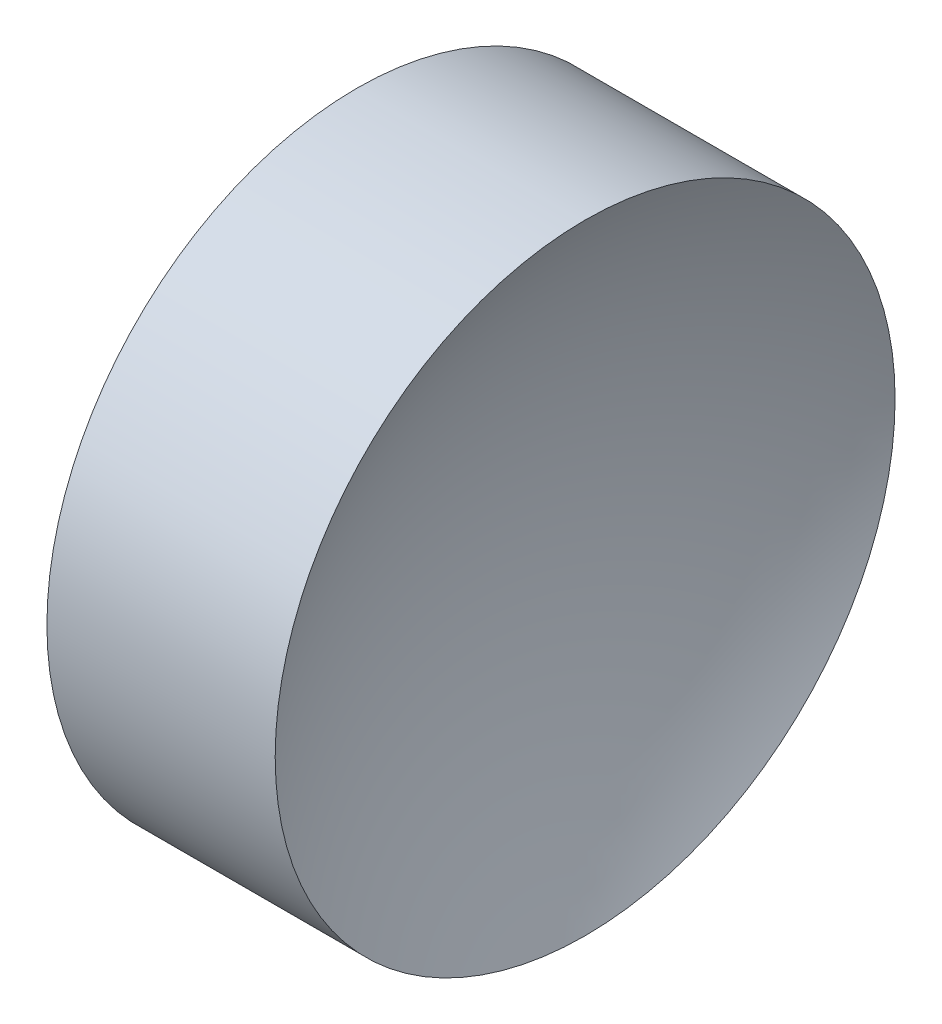
ISO-10303-21;
HEADER;
FILE_DESCRIPTION(('STEP AP214'),'2;1');
FILE_NAME('part.step','',(''),(''),'','','');
FILE_SCHEMA(('AUTOMOTIVE_DESIGN { 1 0 10303 214 1 1 1 1 }'));
ENDSEC;
DATA;
#1=APPLICATION_CONTEXT('core data for automotive mechanical design processes');
#2=APPLICATION_PROTOCOL_DEFINITION('international standard','automotive_design',2000,#1);
#3=PRODUCT_CONTEXT('',#1,'mechanical');
#4=PRODUCT('Part','Part','',(#3));
#5=PRODUCT_RELATED_PRODUCT_CATEGORY('part','',(#4));
#6=PRODUCT_DEFINITION_FORMATION('','',#4);
#7=PRODUCT_DEFINITION_CONTEXT('part definition',#1,'design');
#8=PRODUCT_DEFINITION('design','',#6,#7);
#9=PRODUCT_DEFINITION_SHAPE('','',#8);
#10=(LENGTH_UNIT() NAMED_UNIT(*) SI_UNIT(.MILLI.,.METRE.));
#11=(NAMED_UNIT(*) PLANE_ANGLE_UNIT() SI_UNIT($,.RADIAN.));
#12=(NAMED_UNIT(*) SI_UNIT($,.STERADIAN.) SOLID_ANGLE_UNIT());
#13=UNCERTAINTY_MEASURE_WITH_UNIT(LENGTH_MEASURE(1.E-05),#10,'distance_accuracy_value','');
#14=(GEOMETRIC_REPRESENTATION_CONTEXT(3) GLOBAL_UNCERTAINTY_ASSIGNED_CONTEXT((#13)) GLOBAL_UNIT_ASSIGNED_CONTEXT((#10,
#11,#12)) REPRESENTATION_CONTEXT('',''));
#15=CARTESIAN_POINT('',(0.,0.,0.));
#16=DIRECTION('',(0.,0.,1.));
#17=DIRECTION('',(1.,0.,0.));
#18=AXIS2_PLACEMENT_3D('',#15,#16,#17);
#19=CARTESIAN_POINT('',(30.1308954596777,13.0445205745975,0.));
#20=DIRECTION('',(-1.,0.,0.));
#21=DIRECTION('',(0.,-1.,0.));
#22=AXIS2_PLACEMENT_3D('',#19,#20,#21);
#23=SPHERICAL_SURFACE('',#22,6.45890897747901);
#24=CARTESIAN_POINT('',(24.4921894752023,13.0445205745975,0.));
#25=DIRECTION('',(-1.,0.,0.));
#26=DIRECTION('',(0.,0.,1.));
#27=AXIS2_PLACEMENT_3D('',#24,#25,#26);
#28=CIRCLE('',#27,3.15);
#29=CARTESIAN_POINT('',(24.4921894752023,13.0445205745975,3.15));
#30=VERTEX_POINT('',#29);
#31=EDGE_CURVE('E10',#30,#30,#28,.T.);
#32=ORIENTED_EDGE('',*,*,#31,.F.);
#33=EDGE_LOOP('',(#32));
#34=FACE_BOUND('',#33,.T.);
#35=ADVANCED_FACE('F35',(#34),#23,.F.);
#36=CARTESIAN_POINT('',(21.2249305570684,13.0445205745975,0.));
#37=DIRECTION('',(-1.,0.,0.));
#38=DIRECTION('',(0.,0.,1.));
#39=AXIS2_PLACEMENT_3D('',#36,#37,#38);
#40=CYLINDRICAL_SURFACE('',#39,3.15);
#41=CARTESIAN_POINT('',(22.1721894752023,13.0445205745975,0.));
#42=DIRECTION('',(-1.,0.,0.));
#43=DIRECTION('',(0.,0.,1.));
#44=AXIS2_PLACEMENT_3D('',#41,#42,#43);
#45=CIRCLE('',#44,3.15);
#46=CARTESIAN_POINT('',(22.1721894752023,13.0445205745975,3.15));
#47=VERTEX_POINT('',#46);
#48=EDGE_CURVE('E41',#47,#47,#45,.T.);
#49=ORIENTED_EDGE('',*,*,#48,.F.);
#50=EDGE_LOOP('',(#49));
#51=FACE_BOUND('',#50,.T.);
#52=ORIENTED_EDGE('',*,*,#31,.T.);
#53=EDGE_LOOP('',(#52));
#54=FACE_BOUND('',#53,.T.);
#55=ADVANCED_FACE('F49',(#51,#54),#40,.T.);
#56=CARTESIAN_POINT('',(22.1721894752023,13.0445205745975,0.));
#57=DIRECTION('',(1.,0.,0.));
#58=DIRECTION('',(0.,0.,-1.));
#59=AXIS2_PLACEMENT_3D('',#56,#57,#58);
#60=PLANE('',#59);
#61=ORIENTED_EDGE('',*,*,#48,.T.);
#62=EDGE_LOOP('',(#61));
#63=FACE_BOUND('',#62,.T.);
#64=ADVANCED_FACE('F47',(#63),#60,.F.);
#65=CLOSED_SHELL('',(#35,#55,#64));
#66=MANIFOLD_SOLID_BREP('B2',#65);
#67=ADVANCED_BREP_SHAPE_REPRESENTATION('',(#18,#66),#14);
#68=SHAPE_DEFINITION_REPRESENTATION(#9,#67);
ENDSEC;
END-ISO-10303-21;
